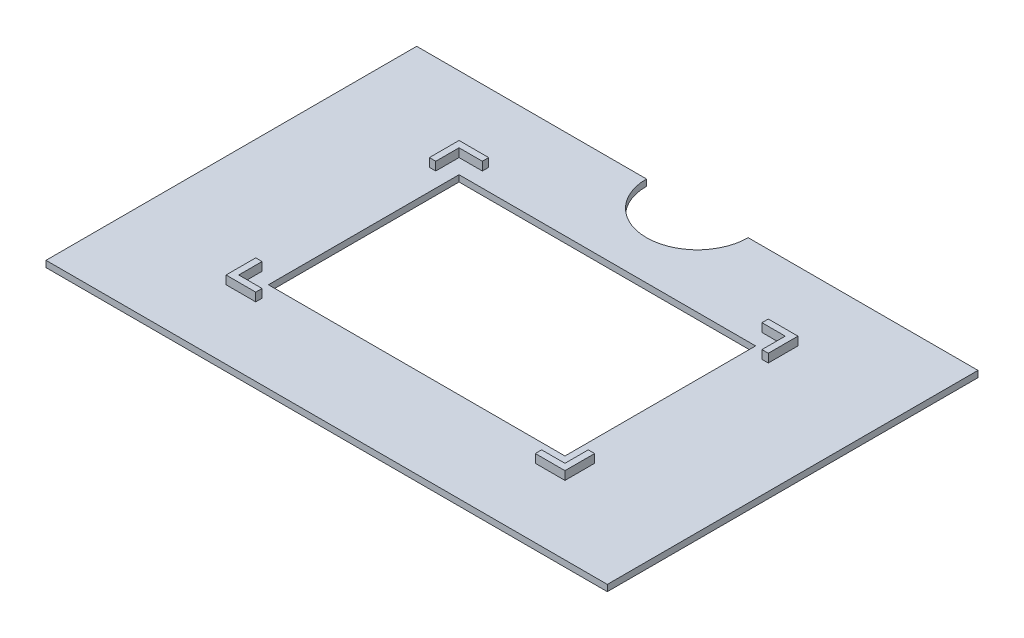
ISO-10303-21;
HEADER;
FILE_DESCRIPTION(('STEP AP214'),'2;1');
FILE_NAME('part.step','',(''),(''),'','','');
FILE_SCHEMA(('AUTOMOTIVE_DESIGN { 1 0 10303 214 1 1 1 1 }'));
ENDSEC;
DATA;
#1=APPLICATION_CONTEXT('core data for automotive mechanical design processes');
#2=APPLICATION_PROTOCOL_DEFINITION('international standard','automotive_design',2000,#1);
#3=PRODUCT_CONTEXT('',#1,'mechanical');
#4=PRODUCT('Part','Part','',(#3));
#5=PRODUCT_RELATED_PRODUCT_CATEGORY('part','',(#4));
#6=PRODUCT_DEFINITION_FORMATION('','',#4);
#7=PRODUCT_DEFINITION_CONTEXT('part definition',#1,'design');
#8=PRODUCT_DEFINITION('design','',#6,#7);
#9=PRODUCT_DEFINITION_SHAPE('','',#8);
#10=(LENGTH_UNIT() NAMED_UNIT(*) SI_UNIT(.MILLI.,.METRE.));
#11=(NAMED_UNIT(*) PLANE_ANGLE_UNIT() SI_UNIT($,.RADIAN.));
#12=(NAMED_UNIT(*) SI_UNIT($,.STERADIAN.) SOLID_ANGLE_UNIT());
#13=UNCERTAINTY_MEASURE_WITH_UNIT(LENGTH_MEASURE(1.E-05),#10,'distance_accuracy_value','');
#14=(GEOMETRIC_REPRESENTATION_CONTEXT(3) GLOBAL_UNCERTAINTY_ASSIGNED_CONTEXT((#13)) GLOBAL_UNIT_ASSIGNED_CONTEXT((#10,
#11,#12)) REPRESENTATION_CONTEXT('',''));
#15=CARTESIAN_POINT('',(0.,0.,0.));
#16=DIRECTION('',(0.,0.,1.));
#17=DIRECTION('',(1.,0.,0.));
#18=AXIS2_PLACEMENT_3D('',#15,#16,#17);
#19=CARTESIAN_POINT('',(66.25,1.5,-43.75));
#20=DIRECTION('',(0.,0.,1.));
#21=DIRECTION('',(1.,0.,0.));
#22=AXIS2_PLACEMENT_3D('',#19,#20,#21);
#23=PLANE('',#22);
#24=DIRECTION('',(-1.,0.,0.));
#25=VECTOR('',#24,1.);
#26=CARTESIAN_POINT('',(66.25,0.,-43.75));
#27=LINE('',#26,#25);
#28=CARTESIAN_POINT('',(66.25,0.,-43.75));
#29=VERTEX_POINT('',#28);
#30=CARTESIAN_POINT('',(12.,0.,-43.75));
#31=VERTEX_POINT('',#30);
#32=EDGE_CURVE('E266',#29,#31,#27,.T.);
#33=ORIENTED_EDGE('',*,*,#32,.T.);
#34=DIRECTION('',(0.,1.,0.));
#35=VECTOR('',#34,1.);
#36=CARTESIAN_POINT('',(12.,-26.8328157299975,-43.75));
#37=LINE('',#36,#35);
#38=CARTESIAN_POINT('',(12.,1.5,-43.75));
#39=VERTEX_POINT('',#38);
#40=EDGE_CURVE('E48',#31,#39,#37,.T.);
#41=ORIENTED_EDGE('',*,*,#40,.T.);
#42=DIRECTION('',(-1.,0.,0.));
#43=VECTOR('',#42,1.);
#44=CARTESIAN_POINT('',(66.25,1.5,-43.75));
#45=LINE('',#44,#43);
#46=CARTESIAN_POINT('',(66.25,1.5,-43.75));
#47=VERTEX_POINT('',#46);
#48=EDGE_CURVE('E264',#47,#39,#45,.T.);
#49=ORIENTED_EDGE('',*,*,#48,.F.);
#50=DIRECTION('',(0.,-1.,0.));
#51=VECTOR('',#50,1.);
#52=CARTESIAN_POINT('',(66.25,1.5,-43.75));
#53=LINE('',#52,#51);
#54=EDGE_CURVE('E277',#47,#29,#53,.T.);
#55=ORIENTED_EDGE('',*,*,#54,.T.);
#56=EDGE_LOOP('',(#33,#41,#49,#55));
#57=FACE_BOUND('',#56,.T.);
#58=ADVANCED_FACE('F33',(#57),#23,.F.);
#59=CARTESIAN_POINT('',(40.,3.5,27.5));
#60=DIRECTION('',(0.,0.,-1.));
#61=DIRECTION('',(-1.,0.,0.));
#62=AXIS2_PLACEMENT_3D('',#59,#60,#61);
#63=PLANE('',#62);
#64=DIRECTION('',(1.,0.,0.));
#65=VECTOR('',#64,1.);
#66=CARTESIAN_POINT('',(40.,1.5,27.5));
#67=LINE('',#66,#65);
#68=CARTESIAN_POINT('',(-40.,1.5,27.5));
#69=VERTEX_POINT('',#68);
#70=CARTESIAN_POINT('',(-33.,1.5,27.5));
#71=VERTEX_POINT('',#70);
#72=EDGE_CURVE('E475',#69,#71,#67,.T.);
#73=ORIENTED_EDGE('',*,*,#72,.T.);
#74=DIRECTION('',(0.,1.,0.));
#75=VECTOR('',#74,1.);
#76=CARTESIAN_POINT('',(-33.,-64.5170432539962,27.5));
#77=LINE('',#76,#75);
#78=CARTESIAN_POINT('',(-33.,3.5,27.5));
#79=VERTEX_POINT('',#78);
#80=EDGE_CURVE('E311',#71,#79,#77,.T.);
#81=ORIENTED_EDGE('',*,*,#80,.T.);
#82=DIRECTION('',(1.,0.,0.));
#83=VECTOR('',#82,1.);
#84=CARTESIAN_POINT('',(40.,3.5,27.5));
#85=LINE('',#84,#83);
#86=CARTESIAN_POINT('',(-40.,3.5,27.5));
#87=VERTEX_POINT('',#86);
#88=EDGE_CURVE('E459',#87,#79,#85,.T.);
#89=ORIENTED_EDGE('',*,*,#88,.F.);
#90=DIRECTION('',(0.,-1.,0.));
#91=VECTOR('',#90,1.);
#92=CARTESIAN_POINT('',(-40.,3.5,27.5));
#93=LINE('',#92,#91);
#94=EDGE_CURVE('E286',#87,#69,#93,.T.);
#95=ORIENTED_EDGE('',*,*,#94,.T.);
#96=EDGE_LOOP('',(#73,#81,#89,#95));
#97=FACE_BOUND('',#96,.T.);
#98=ADVANCED_FACE('F516',(#97),#63,.F.);
#99=CARTESIAN_POINT('',(0.,3.5,0.));
#100=DIRECTION('',(0.,1.,0.));
#101=DIRECTION('',(0.,0.,1.));
#102=AXIS2_PLACEMENT_3D('',#99,#100,#101);
#103=PLANE('',#102);
#104=DIRECTION('',(0.,0.,1.));
#105=VECTOR('',#104,1.);
#106=CARTESIAN_POINT('',(-33.,3.5,27.5));
#107=LINE('',#106,#105);
#108=CARTESIAN_POINT('',(-33.,3.5,26.));
#109=VERTEX_POINT('',#108);
#110=EDGE_CURVE('E306',#109,#79,#107,.T.);
#111=ORIENTED_EDGE('',*,*,#110,.F.);
#112=DIRECTION('',(1.,0.,0.));
#113=VECTOR('',#112,1.);
#114=CARTESIAN_POINT('',(38.5,3.5,26.));
#115=LINE('',#114,#113);
#116=CARTESIAN_POINT('',(-38.5,3.5,26.));
#117=VERTEX_POINT('',#116);
#118=EDGE_CURVE('E431',#117,#109,#115,.T.);
#119=ORIENTED_EDGE('',*,*,#118,.F.);
#120=DIRECTION('',(0.,0.,1.));
#121=VECTOR('',#120,1.);
#122=CARTESIAN_POINT('',(-38.5,3.5,26.));
#123=LINE('',#122,#121);
#124=CARTESIAN_POINT('',(-38.5,3.5,20.5));
#125=VERTEX_POINT('',#124);
#126=EDGE_CURVE('E409',#125,#117,#123,.T.);
#127=ORIENTED_EDGE('',*,*,#126,.F.);
#128=DIRECTION('',(1.,0.,0.));
#129=VECTOR('',#128,1.);
#130=CARTESIAN_POINT('',(-38.5,3.5,20.5));
#131=LINE('',#130,#129);
#132=CARTESIAN_POINT('',(-40.,3.5,20.5));
#133=VERTEX_POINT('',#132);
#134=EDGE_CURVE('E366',#133,#125,#131,.T.);
#135=ORIENTED_EDGE('',*,*,#134,.F.);
#136=DIRECTION('',(0.,0.,1.));
#137=VECTOR('',#136,1.);
#138=CARTESIAN_POINT('',(-40.,3.5,27.5));
#139=LINE('',#138,#137);
#140=EDGE_CURVE('E458',#133,#87,#139,.T.);
#141=ORIENTED_EDGE('',*,*,#140,.T.);
#142=ORIENTED_EDGE('',*,*,#88,.T.);
#143=EDGE_LOOP('',(#111,#119,#127,#135,#141,#142));
#144=FACE_BOUND('',#143,.T.);
#145=ADVANCED_FACE('F520',(#144),#103,.T.);
#146=CARTESIAN_POINT('',(38.5,1.5,26.));
#147=DIRECTION('',(0.,0.,1.));
#148=DIRECTION('',(1.,0.,0.));
#149=AXIS2_PLACEMENT_3D('',#146,#147,#148);
#150=PLANE('',#149);
#151=ORIENTED_EDGE('',*,*,#118,.T.);
#152=DIRECTION('',(0.,1.,0.));
#153=VECTOR('',#152,1.);
#154=CARTESIAN_POINT('',(-33.,-64.5170432539962,26.));
#155=LINE('',#154,#153);
#156=CARTESIAN_POINT('',(-33.,1.5,26.));
#157=VERTEX_POINT('',#156);
#158=EDGE_CURVE('E317',#157,#109,#155,.T.);
#159=ORIENTED_EDGE('',*,*,#158,.F.);
#160=DIRECTION('',(1.,0.,0.));
#161=VECTOR('',#160,1.);
#162=CARTESIAN_POINT('',(38.5,1.5,26.));
#163=LINE('',#162,#161);
#164=CARTESIAN_POINT('',(-38.5,1.5,26.));
#165=VERTEX_POINT('',#164);
#166=EDGE_CURVE('E415',#165,#157,#163,.T.);
#167=ORIENTED_EDGE('',*,*,#166,.F.);
#168=DIRECTION('',(0.,1.,0.));
#169=VECTOR('',#168,1.);
#170=CARTESIAN_POINT('',(-38.5,1.5,26.));
#171=LINE('',#170,#169);
#172=EDGE_CURVE('E426',#165,#117,#171,.T.);
#173=ORIENTED_EDGE('',*,*,#172,.T.);
#174=EDGE_LOOP('',(#151,#159,#167,#173));
#175=FACE_BOUND('',#174,.T.);
#176=ADVANCED_FACE('F527',(#175),#150,.F.);
#177=DIRECTION('',(0.,0.,1.));
#178=VECTOR('',#177,1.);
#179=CARTESIAN_POINT('',(-33.,3.5,-27.5));
#180=LINE('',#179,#178);
#181=CARTESIAN_POINT('',(-33.,3.5,-27.5));
#182=VERTEX_POINT('',#181);
#183=CARTESIAN_POINT('',(-33.,3.5,-26.));
#184=VERTEX_POINT('',#183);
#185=EDGE_CURVE('E324',#182,#184,#180,.T.);
#186=ORIENTED_EDGE('',*,*,#185,.F.);
#187=DIRECTION('',(-1.,0.,0.));
#188=VECTOR('',#187,1.);
#189=CARTESIAN_POINT('',(40.,3.5,-27.5));
#190=LINE('',#189,#188);
#191=CARTESIAN_POINT('',(-40.,3.5,-27.5));
#192=VERTEX_POINT('',#191);
#193=EDGE_CURVE('E466',#182,#192,#190,.T.);
#194=ORIENTED_EDGE('',*,*,#193,.T.);
#195=CARTESIAN_POINT('',(-40.,3.5,-20.5));
#196=VERTEX_POINT('',#195);
#197=EDGE_CURVE('E454',#192,#196,#139,.T.);
#198=ORIENTED_EDGE('',*,*,#197,.T.);
#199=DIRECTION('',(-1.,0.,0.));
#200=VECTOR('',#199,1.);
#201=CARTESIAN_POINT('',(-38.5,3.5,-20.5));
#202=LINE('',#201,#200);
#203=CARTESIAN_POINT('',(-38.5,3.5,-20.5));
#204=VERTEX_POINT('',#203);
#205=EDGE_CURVE('E360',#204,#196,#202,.T.);
#206=ORIENTED_EDGE('',*,*,#205,.F.);
#207=CARTESIAN_POINT('',(-38.5,3.5,-26.));
#208=VERTEX_POINT('',#207);
#209=EDGE_CURVE('E427',#208,#204,#123,.T.);
#210=ORIENTED_EDGE('',*,*,#209,.F.);
#211=DIRECTION('',(-1.,0.,0.));
#212=VECTOR('',#211,1.);
#213=CARTESIAN_POINT('',(38.5,3.5,-26.));
#214=LINE('',#213,#212);
#215=EDGE_CURVE('E438',#184,#208,#214,.T.);
#216=ORIENTED_EDGE('',*,*,#215,.F.);
#217=EDGE_LOOP('',(#186,#194,#198,#206,#210,#216));
#218=FACE_BOUND('',#217,.T.);
#219=ADVANCED_FACE('F530',(#218),#103,.T.);
#220=CARTESIAN_POINT('',(40.,3.5,-27.5));
#221=DIRECTION('',(0.,0.,1.));
#222=DIRECTION('',(1.,0.,0.));
#223=AXIS2_PLACEMENT_3D('',#220,#221,#222);
#224=PLANE('',#223);
#225=ORIENTED_EDGE('',*,*,#193,.F.);
#226=DIRECTION('',(0.,1.,0.));
#227=VECTOR('',#226,1.);
#228=CARTESIAN_POINT('',(-33.,-64.5170432539962,-27.5));
#229=LINE('',#228,#227);
#230=CARTESIAN_POINT('',(-33.,1.5,-27.5));
#231=VERTEX_POINT('',#230);
#232=EDGE_CURVE('E328',#231,#182,#229,.T.);
#233=ORIENTED_EDGE('',*,*,#232,.F.);
#234=DIRECTION('',(-1.,0.,0.));
#235=VECTOR('',#234,1.);
#236=CARTESIAN_POINT('',(40.,1.5,-27.5));
#237=LINE('',#236,#235);
#238=CARTESIAN_POINT('',(-40.,1.5,-27.5));
#239=VERTEX_POINT('',#238);
#240=EDGE_CURVE('E482',#231,#239,#237,.T.);
#241=ORIENTED_EDGE('',*,*,#240,.T.);
#242=DIRECTION('',(0.,-1.,0.));
#243=VECTOR('',#242,1.);
#244=CARTESIAN_POINT('',(-40.,3.5,-27.5));
#245=LINE('',#244,#243);
#246=EDGE_CURVE('E470',#192,#239,#245,.T.);
#247=ORIENTED_EDGE('',*,*,#246,.F.);
#248=EDGE_LOOP('',(#225,#233,#241,#247));
#249=FACE_BOUND('',#248,.T.);
#250=ADVANCED_FACE('F627',(#249),#224,.F.);
#251=CARTESIAN_POINT('',(38.5,1.5,-26.));
#252=DIRECTION('',(0.,0.,-1.));
#253=DIRECTION('',(-1.,0.,0.));
#254=AXIS2_PLACEMENT_3D('',#251,#252,#253);
#255=PLANE('',#254);
#256=DIRECTION('',(-1.,0.,0.));
#257=VECTOR('',#256,1.);
#258=CARTESIAN_POINT('',(38.5,1.5,-26.));
#259=LINE('',#258,#257);
#260=CARTESIAN_POINT('',(-33.,1.5,-26.));
#261=VERTEX_POINT('',#260);
#262=CARTESIAN_POINT('',(-38.5,1.5,-26.));
#263=VERTEX_POINT('',#262);
#264=EDGE_CURVE('E422',#261,#263,#259,.T.);
#265=ORIENTED_EDGE('',*,*,#264,.F.);
#266=DIRECTION('',(0.,1.,0.));
#267=VECTOR('',#266,1.);
#268=CARTESIAN_POINT('',(-33.,-64.5170432539962,-26.));
#269=LINE('',#268,#267);
#270=EDGE_CURVE('E334',#261,#184,#269,.T.);
#271=ORIENTED_EDGE('',*,*,#270,.T.);
#272=ORIENTED_EDGE('',*,*,#215,.T.);
#273=DIRECTION('',(0.,1.,0.));
#274=VECTOR('',#273,1.);
#275=CARTESIAN_POINT('',(-38.5,1.5,-26.));
#276=LINE('',#275,#274);
#277=EDGE_CURVE('E442',#263,#208,#276,.T.);
#278=ORIENTED_EDGE('',*,*,#277,.F.);
#279=EDGE_LOOP('',(#265,#271,#272,#278));
#280=FACE_BOUND('',#279,.T.);
#281=ADVANCED_FACE('F613',(#280),#255,.F.);
#282=CARTESIAN_POINT('',(40.,3.5,27.5));
#283=DIRECTION('',(-1.,0.,0.));
#284=DIRECTION('',(0.,0.,1.));
#285=AXIS2_PLACEMENT_3D('',#282,#283,#284);
#286=PLANE('',#285);
#287=DIRECTION('',(0.,0.,-1.));
#288=VECTOR('',#287,1.);
#289=CARTESIAN_POINT('',(40.,3.5,27.5));
#290=LINE('',#289,#288);
#291=CARTESIAN_POINT('',(40.,3.5,-20.5));
#292=VERTEX_POINT('',#291);
#293=CARTESIAN_POINT('',(40.,3.5,-27.5));
#294=VERTEX_POINT('',#293);
#295=EDGE_CURVE('E462',#292,#294,#290,.T.);
#296=ORIENTED_EDGE('',*,*,#295,.F.);
#297=DIRECTION('',(0.,1.,0.));
#298=VECTOR('',#297,1.);
#299=CARTESIAN_POINT('',(40.,-64.5170432539962,-20.5));
#300=LINE('',#299,#298);
#301=CARTESIAN_POINT('',(40.,1.5,-20.5));
#302=VERTEX_POINT('',#301);
#303=EDGE_CURVE('E353',#302,#292,#300,.T.);
#304=ORIENTED_EDGE('',*,*,#303,.F.);
#305=DIRECTION('',(0.,0.,-1.));
#306=VECTOR('',#305,1.);
#307=CARTESIAN_POINT('',(40.,1.5,27.5));
#308=LINE('',#307,#306);
#309=CARTESIAN_POINT('',(40.,1.5,-27.5));
#310=VERTEX_POINT('',#309);
#311=EDGE_CURVE('E478',#302,#310,#308,.T.);
#312=ORIENTED_EDGE('',*,*,#311,.T.);
#313=DIRECTION('',(0.,-1.,0.));
#314=VECTOR('',#313,1.);
#315=CARTESIAN_POINT('',(40.,3.5,-27.5));
#316=LINE('',#315,#314);
#317=EDGE_CURVE('E488',#294,#310,#316,.T.);
#318=ORIENTED_EDGE('',*,*,#317,.F.);
#319=EDGE_LOOP('',(#296,#304,#312,#318));
#320=FACE_BOUND('',#319,.T.);
#321=ADVANCED_FACE('F543',(#320),#286,.F.);
#322=DIRECTION('',(0.,0.,-1.));
#323=VECTOR('',#322,1.);
#324=CARTESIAN_POINT('',(33.,3.5,-27.5));
#325=LINE('',#324,#323);
#326=CARTESIAN_POINT('',(33.,3.5,-26.));
#327=VERTEX_POINT('',#326);
#328=CARTESIAN_POINT('',(33.,3.5,-27.5));
#329=VERTEX_POINT('',#328);
#330=EDGE_CURVE('E332',#327,#329,#325,.T.);
#331=ORIENTED_EDGE('',*,*,#330,.F.);
#332=CARTESIAN_POINT('',(38.5,3.5,-26.));
#333=VERTEX_POINT('',#332);
#334=EDGE_CURVE('E439',#333,#327,#214,.T.);
#335=ORIENTED_EDGE('',*,*,#334,.F.);
#336=DIRECTION('',(0.,0.,-1.));
#337=VECTOR('',#336,1.);
#338=CARTESIAN_POINT('',(38.5,3.5,26.));
#339=LINE('',#338,#337);
#340=CARTESIAN_POINT('',(38.5,3.5,-20.5));
#341=VERTEX_POINT('',#340);
#342=EDGE_CURVE('E434',#341,#333,#339,.T.);
#343=ORIENTED_EDGE('',*,*,#342,.F.);
#344=DIRECTION('',(-1.,0.,0.));
#345=VECTOR('',#344,1.);
#346=CARTESIAN_POINT('',(38.5,3.5,-20.5));
#347=LINE('',#346,#345);
#348=EDGE_CURVE('E348',#292,#341,#347,.T.);
#349=ORIENTED_EDGE('',*,*,#348,.F.);
#350=ORIENTED_EDGE('',*,*,#295,.T.);
#351=EDGE_CURVE('E467',#294,#329,#190,.T.);
#352=ORIENTED_EDGE('',*,*,#351,.T.);
#353=EDGE_LOOP('',(#331,#335,#343,#349,#350,#352));
#354=FACE_BOUND('',#353,.T.);
#355=ADVANCED_FACE('F624',(#354),#103,.T.);
#356=CARTESIAN_POINT('',(38.5,1.5,26.));
#357=DIRECTION('',(1.,0.,0.));
#358=DIRECTION('',(0.,0.,-1.));
#359=AXIS2_PLACEMENT_3D('',#356,#357,#358);
#360=PLANE('',#359);
#361=DIRECTION('',(0.,0.,-1.));
#362=VECTOR('',#361,1.);
#363=CARTESIAN_POINT('',(38.5,1.5,26.));
#364=LINE('',#363,#362);
#365=CARTESIAN_POINT('',(38.5,1.5,-20.5));
#366=VERTEX_POINT('',#365);
#367=CARTESIAN_POINT('',(38.5,1.5,-26.));
#368=VERTEX_POINT('',#367);
#369=EDGE_CURVE('E418',#366,#368,#364,.T.);
#370=ORIENTED_EDGE('',*,*,#369,.F.);
#371=DIRECTION('',(0.,1.,0.));
#372=VECTOR('',#371,1.);
#373=CARTESIAN_POINT('',(38.5,-64.5170432539962,-20.5));
#374=LINE('',#373,#372);
#375=EDGE_CURVE('E346',#366,#341,#374,.T.);
#376=ORIENTED_EDGE('',*,*,#375,.T.);
#377=ORIENTED_EDGE('',*,*,#342,.T.);
#378=DIRECTION('',(0.,1.,0.));
#379=VECTOR('',#378,1.);
#380=CARTESIAN_POINT('',(38.5,1.5,-26.));
#381=LINE('',#380,#379);
#382=EDGE_CURVE('E446',#368,#333,#381,.T.);
#383=ORIENTED_EDGE('',*,*,#382,.F.);
#384=EDGE_LOOP('',(#370,#376,#377,#383));
#385=FACE_BOUND('',#384,.T.);
#386=ADVANCED_FACE('F616',(#385),#360,.F.);
#387=CARTESIAN_POINT('',(-40.,3.5,27.5));
#388=DIRECTION('',(1.,0.,0.));
#389=DIRECTION('',(0.,0.,-1.));
#390=AXIS2_PLACEMENT_3D('',#387,#388,#389);
#391=PLANE('',#390);
#392=ORIENTED_EDGE('',*,*,#140,.F.);
#393=DIRECTION('',(0.,1.,0.));
#394=VECTOR('',#393,1.);
#395=CARTESIAN_POINT('',(-40.,-64.5170432539962,20.5));
#396=LINE('',#395,#394);
#397=CARTESIAN_POINT('',(-40.,1.5,20.5));
#398=VERTEX_POINT('',#397);
#399=EDGE_CURVE('E371',#398,#133,#396,.T.);
#400=ORIENTED_EDGE('',*,*,#399,.F.);
#401=DIRECTION('',(0.,0.,1.));
#402=VECTOR('',#401,1.);
#403=CARTESIAN_POINT('',(-40.,1.5,27.5));
#404=LINE('',#403,#402);
#405=EDGE_CURVE('E445',#398,#69,#404,.T.);
#406=ORIENTED_EDGE('',*,*,#405,.T.);
#407=ORIENTED_EDGE('',*,*,#94,.F.);
#408=EDGE_LOOP('',(#392,#400,#406,#407));
#409=FACE_BOUND('',#408,.T.);
#410=ADVANCED_FACE('F545',(#409),#391,.F.);
#411=CARTESIAN_POINT('',(-38.5,1.5,26.));
#412=DIRECTION('',(-1.,0.,0.));
#413=DIRECTION('',(0.,0.,1.));
#414=AXIS2_PLACEMENT_3D('',#411,#412,#413);
#415=PLANE('',#414);
#416=DIRECTION('',(0.,0.,1.));
#417=VECTOR('',#416,1.);
#418=CARTESIAN_POINT('',(-38.5,1.5,26.));
#419=LINE('',#418,#417);
#420=CARTESIAN_POINT('',(-38.5,1.5,20.5));
#421=VERTEX_POINT('',#420);
#422=EDGE_CURVE('E414',#421,#165,#419,.T.);
#423=ORIENTED_EDGE('',*,*,#422,.F.);
#424=DIRECTION('',(0.,1.,0.));
#425=VECTOR('',#424,1.);
#426=CARTESIAN_POINT('',(-38.5,-64.5170432539962,20.5));
#427=LINE('',#426,#425);
#428=EDGE_CURVE('E364',#421,#125,#427,.T.);
#429=ORIENTED_EDGE('',*,*,#428,.T.);
#430=ORIENTED_EDGE('',*,*,#126,.T.);
#431=ORIENTED_EDGE('',*,*,#172,.F.);
#432=EDGE_LOOP('',(#423,#429,#430,#431));
#433=FACE_BOUND('',#432,.T.);
#434=ADVANCED_FACE('F621',(#433),#415,.F.);
#435=CARTESIAN_POINT('',(0.,1.5,0.));
#436=DIRECTION('',(0.,1.,0.));
#437=DIRECTION('',(0.,0.,1.));
#438=AXIS2_PLACEMENT_3D('',#435,#436,#437);
#439=PLANE('',#438);
#440=CARTESIAN_POINT('',(0.,1.5,-43.75));
#441=DIRECTION('',(0.,1.,0.));
#442=DIRECTION('',(0.,0.,1.));
#443=AXIS2_PLACEMENT_3D('',#440,#441,#442);
#444=CIRCLE('',#443,12.);
#445=CARTESIAN_POINT('',(-12.,1.5,-43.75));
#446=VERTEX_POINT('',#445);
#447=EDGE_CURVE('E252',#446,#39,#444,.T.);
#448=ORIENTED_EDGE('',*,*,#447,.F.);
#449=CARTESIAN_POINT('',(-66.25,1.5,-43.75));
#450=VERTEX_POINT('',#449);
#451=EDGE_CURVE('E274',#446,#450,#45,.T.);
#452=ORIENTED_EDGE('',*,*,#451,.T.);
#453=DIRECTION('',(0.,0.,1.));
#454=VECTOR('',#453,1.);
#455=CARTESIAN_POINT('',(-66.25,1.5,43.75));
#456=LINE('',#455,#454);
#457=CARTESIAN_POINT('',(-66.25,1.5,43.75));
#458=VERTEX_POINT('',#457);
#459=EDGE_CURVE('E291',#450,#458,#456,.T.);
#460=ORIENTED_EDGE('',*,*,#459,.T.);
#461=DIRECTION('',(1.,0.,0.));
#462=VECTOR('',#461,1.);
#463=CARTESIAN_POINT('',(66.25,1.5,43.75));
#464=LINE('',#463,#462);
#465=CARTESIAN_POINT('',(66.25,1.5,43.75));
#466=VERTEX_POINT('',#465);
#467=EDGE_CURVE('E497',#458,#466,#464,.T.);
#468=ORIENTED_EDGE('',*,*,#467,.T.);
#469=DIRECTION('',(0.,0.,-1.));
#470=VECTOR('',#469,1.);
#471=CARTESIAN_POINT('',(66.25,1.5,43.75));
#472=LINE('',#471,#470);
#473=EDGE_CURVE('E271',#466,#47,#472,.T.);
#474=ORIENTED_EDGE('',*,*,#473,.T.);
#475=ORIENTED_EDGE('',*,*,#48,.T.);
#476=EDGE_LOOP('',(#448,#452,#460,#468,#474,#475));
#477=FACE_BOUND('',#476,.T.);
#478=DIRECTION('',(0.,0.,-1.));
#479=VECTOR('',#478,1.);
#480=CARTESIAN_POINT('',(-33.,1.5,27.5));
#481=LINE('',#480,#479);
#482=EDGE_CURVE('E310',#71,#157,#481,.T.);
#483=ORIENTED_EDGE('',*,*,#482,.F.);
#484=ORIENTED_EDGE('',*,*,#72,.F.);
#485=ORIENTED_EDGE('',*,*,#405,.F.);
#486=DIRECTION('',(-1.,0.,0.));
#487=VECTOR('',#486,1.);
#488=CARTESIAN_POINT('',(-38.5,1.5,20.5));
#489=LINE('',#488,#487);
#490=EDGE_CURVE('E361',#421,#398,#489,.T.);
#491=ORIENTED_EDGE('',*,*,#490,.F.);
#492=ORIENTED_EDGE('',*,*,#422,.T.);
#493=ORIENTED_EDGE('',*,*,#166,.T.);
#494=EDGE_LOOP('',(#483,#484,#485,#491,#492,#493));
#495=FACE_BOUND('',#494,.T.);
#496=DIRECTION('',(0.,0.,1.));
#497=VECTOR('',#496,1.);
#498=CARTESIAN_POINT('',(33.,1.5,-27.5));
#499=LINE('',#498,#497);
#500=CARTESIAN_POINT('',(33.,1.5,-27.5));
#501=VERTEX_POINT('',#500);
#502=CARTESIAN_POINT('',(33.,1.5,-26.));
#503=VERTEX_POINT('',#502);
#504=EDGE_CURVE('E325',#501,#503,#499,.T.);
#505=ORIENTED_EDGE('',*,*,#504,.F.);
#506=EDGE_CURVE('E483',#310,#501,#237,.T.);
#507=ORIENTED_EDGE('',*,*,#506,.F.);
#508=ORIENTED_EDGE('',*,*,#311,.F.);
#509=DIRECTION('',(1.,0.,0.));
#510=VECTOR('',#509,1.);
#511=CARTESIAN_POINT('',(38.5,1.5,-20.5));
#512=LINE('',#511,#510);
#513=EDGE_CURVE('E343',#366,#302,#512,.T.);
#514=ORIENTED_EDGE('',*,*,#513,.F.);
#515=ORIENTED_EDGE('',*,*,#369,.T.);
#516=EDGE_CURVE('E423',#368,#503,#259,.T.);
#517=ORIENTED_EDGE('',*,*,#516,.T.);
#518=EDGE_LOOP('',(#505,#507,#508,#514,#515,#517));
#519=FACE_BOUND('',#518,.T.);
#520=DIRECTION('',(-1.,0.,0.));
#521=VECTOR('',#520,1.);
#522=CARTESIAN_POINT('',(38.5,1.5,20.5));
#523=LINE('',#522,#521);
#524=CARTESIAN_POINT('',(40.,1.5,20.5));
#525=VERTEX_POINT('',#524);
#526=CARTESIAN_POINT('',(38.5,1.5,20.5));
#527=VERTEX_POINT('',#526);
#528=EDGE_CURVE('E345',#525,#527,#523,.T.);
#529=ORIENTED_EDGE('',*,*,#528,.F.);
#530=CARTESIAN_POINT('',(40.,1.5,27.5));
#531=VERTEX_POINT('',#530);
#532=EDGE_CURVE('E479',#531,#525,#308,.T.);
#533=ORIENTED_EDGE('',*,*,#532,.F.);
#534=CARTESIAN_POINT('',(33.,1.5,27.5));
#535=VERTEX_POINT('',#534);
#536=EDGE_CURVE('E474',#535,#531,#67,.T.);
#537=ORIENTED_EDGE('',*,*,#536,.F.);
#538=DIRECTION('',(0.,0.,1.));
#539=VECTOR('',#538,1.);
#540=CARTESIAN_POINT('',(33.,1.5,27.5));
#541=LINE('',#540,#539);
#542=CARTESIAN_POINT('',(33.,1.5,26.));
#543=VERTEX_POINT('',#542);
#544=EDGE_CURVE('E56',#543,#535,#541,.T.);
#545=ORIENTED_EDGE('',*,*,#544,.F.);
#546=CARTESIAN_POINT('',(38.5,1.5,26.));
#547=VERTEX_POINT('',#546);
#548=EDGE_CURVE('E413',#543,#547,#163,.T.);
#549=ORIENTED_EDGE('',*,*,#548,.T.);
#550=EDGE_CURVE('E419',#547,#527,#364,.T.);
#551=ORIENTED_EDGE('',*,*,#550,.T.);
#552=EDGE_LOOP('',(#529,#533,#537,#545,#549,#551));
#553=FACE_BOUND('',#552,.T.);
#554=ORIENTED_EDGE('',*,*,#240,.F.);
#555=DIRECTION('',(0.,0.,-1.));
#556=VECTOR('',#555,1.);
#557=CARTESIAN_POINT('',(-33.,1.5,-27.5));
#558=LINE('',#557,#556);
#559=EDGE_CURVE('E327',#261,#231,#558,.T.);
#560=ORIENTED_EDGE('',*,*,#559,.F.);
#561=ORIENTED_EDGE('',*,*,#264,.T.);
#562=CARTESIAN_POINT('',(-38.5,1.5,-20.5));
#563=VERTEX_POINT('',#562);
#564=EDGE_CURVE('E410',#263,#563,#419,.T.);
#565=ORIENTED_EDGE('',*,*,#564,.T.);
#566=DIRECTION('',(1.,0.,0.));
#567=VECTOR('',#566,1.);
#568=CARTESIAN_POINT('',(-38.5,1.5,-20.5));
#569=LINE('',#568,#567);
#570=CARTESIAN_POINT('',(-40.,1.5,-20.5));
#571=VERTEX_POINT('',#570);
#572=EDGE_CURVE('E363',#571,#563,#569,.T.);
#573=ORIENTED_EDGE('',*,*,#572,.F.);
#574=EDGE_CURVE('E471',#239,#571,#404,.T.);
#575=ORIENTED_EDGE('',*,*,#574,.F.);
#576=EDGE_LOOP('',(#554,#560,#561,#565,#573,#575));
#577=FACE_BOUND('',#576,.T.);
#578=DIRECTION('',(0.,0.,-1.));
#579=VECTOR('',#578,1.);
#580=CARTESIAN_POINT('',(35.,1.5,-22.5));
#581=LINE('',#580,#579);
#582=CARTESIAN_POINT('',(35.,1.5,22.5));
#583=VERTEX_POINT('',#582);
#584=CARTESIAN_POINT('',(35.,1.5,-22.5));
#585=VERTEX_POINT('',#584);
#586=EDGE_CURVE('E386',#583,#585,#581,.T.);
#587=ORIENTED_EDGE('',*,*,#586,.F.);
#588=DIRECTION('',(1.,0.,0.));
#589=VECTOR('',#588,1.);
#590=CARTESIAN_POINT('',(-35.,1.5,22.5));
#591=LINE('',#590,#589);
#592=CARTESIAN_POINT('',(-35.,1.5,22.5));
#593=VERTEX_POINT('',#592);
#594=EDGE_CURVE('E394',#593,#583,#591,.T.);
#595=ORIENTED_EDGE('',*,*,#594,.F.);
#596=DIRECTION('',(0.,0.,1.));
#597=VECTOR('',#596,1.);
#598=CARTESIAN_POINT('',(-35.,1.5,-22.5));
#599=LINE('',#598,#597);
#600=CARTESIAN_POINT('',(-35.,1.5,-22.5));
#601=VERTEX_POINT('',#600);
#602=EDGE_CURVE('E391',#601,#593,#599,.T.);
#603=ORIENTED_EDGE('',*,*,#602,.F.);
#604=DIRECTION('',(-1.,0.,0.));
#605=VECTOR('',#604,1.);
#606=CARTESIAN_POINT('',(-35.,1.5,-22.5));
#607=LINE('',#606,#605);
#608=EDGE_CURVE('E388',#585,#601,#607,.T.);
#609=ORIENTED_EDGE('',*,*,#608,.F.);
#610=EDGE_LOOP('',(#587,#595,#603,#609));
#611=FACE_BOUND('',#610,.T.);
#612=ADVANCED_FACE('F268',(#477,#495,#519,#553,#577,#611),#439,.T.);
#613=CARTESIAN_POINT('',(-66.25,1.5,43.75));
#614=DIRECTION('',(1.,0.,0.));
#615=DIRECTION('',(0.,0.,-1.));
#616=AXIS2_PLACEMENT_3D('',#613,#614,#615);
#617=PLANE('',#616);
#618=DIRECTION('',(0.,0.,1.));
#619=VECTOR('',#618,1.);
#620=CARTESIAN_POINT('',(-66.25,0.,43.75));
#621=LINE('',#620,#619);
#622=CARTESIAN_POINT('',(-66.25,0.,-43.75));
#623=VERTEX_POINT('',#622);
#624=CARTESIAN_POINT('',(-66.25,0.,43.75));
#625=VERTEX_POINT('',#624);
#626=EDGE_CURVE('E282',#623,#625,#621,.T.);
#627=ORIENTED_EDGE('',*,*,#626,.T.);
#628=DIRECTION('',(0.,-1.,0.));
#629=VECTOR('',#628,1.);
#630=CARTESIAN_POINT('',(-66.25,1.5,43.75));
#631=LINE('',#630,#629);
#632=EDGE_CURVE('E11',#458,#625,#631,.T.);
#633=ORIENTED_EDGE('',*,*,#632,.F.);
#634=ORIENTED_EDGE('',*,*,#459,.F.);
#635=DIRECTION('',(0.,-1.,0.));
#636=VECTOR('',#635,1.);
#637=CARTESIAN_POINT('',(-66.25,1.5,-43.75));
#638=LINE('',#637,#636);
#639=EDGE_CURVE('E273',#450,#623,#638,.T.);
#640=ORIENTED_EDGE('',*,*,#639,.T.);
#641=EDGE_LOOP('',(#627,#633,#634,#640));
#642=FACE_BOUND('',#641,.T.);
#643=ADVANCED_FACE('F35',(#642),#617,.F.);
#644=CARTESIAN_POINT('',(66.25,1.5,43.75));
#645=DIRECTION('',(0.,0.,-1.));
#646=DIRECTION('',(-1.,0.,0.));
#647=AXIS2_PLACEMENT_3D('',#644,#645,#646);
#648=PLANE('',#647);
#649=DIRECTION('',(1.,0.,0.));
#650=VECTOR('',#649,1.);
#651=CARTESIAN_POINT('',(66.25,0.,43.75));
#652=LINE('',#651,#650);
#653=CARTESIAN_POINT('',(66.25,0.,43.75));
#654=VERTEX_POINT('',#653);
#655=EDGE_CURVE('E285',#625,#654,#652,.T.);
#656=ORIENTED_EDGE('',*,*,#655,.T.);
#657=DIRECTION('',(0.,-1.,0.));
#658=VECTOR('',#657,1.);
#659=CARTESIAN_POINT('',(66.25,1.5,43.75));
#660=LINE('',#659,#658);
#661=EDGE_CURVE('E41',#466,#654,#660,.T.);
#662=ORIENTED_EDGE('',*,*,#661,.F.);
#663=ORIENTED_EDGE('',*,*,#467,.F.);
#664=ORIENTED_EDGE('',*,*,#632,.T.);
#665=EDGE_LOOP('',(#656,#662,#663,#664));
#666=FACE_BOUND('',#665,.T.);
#667=ADVANCED_FACE('F500',(#666),#648,.F.);
#668=CARTESIAN_POINT('',(66.25,1.5,43.75));
#669=DIRECTION('',(-1.,0.,0.));
#670=DIRECTION('',(0.,0.,1.));
#671=AXIS2_PLACEMENT_3D('',#668,#669,#670);
#672=PLANE('',#671);
#673=DIRECTION('',(0.,0.,-1.));
#674=VECTOR('',#673,1.);
#675=CARTESIAN_POINT('',(66.25,0.,43.75));
#676=LINE('',#675,#674);
#677=EDGE_CURVE('E288',#654,#29,#676,.T.);
#678=ORIENTED_EDGE('',*,*,#677,.T.);
#679=ORIENTED_EDGE('',*,*,#54,.F.);
#680=ORIENTED_EDGE('',*,*,#473,.F.);
#681=ORIENTED_EDGE('',*,*,#661,.T.);
#682=EDGE_LOOP('',(#678,#679,#680,#681));
#683=FACE_BOUND('',#682,.T.);
#684=ADVANCED_FACE('F297',(#683),#672,.F.);
#685=ORIENTED_EDGE('',*,*,#451,.F.);
#686=DIRECTION('',(0.,1.,0.));
#687=VECTOR('',#686,1.);
#688=CARTESIAN_POINT('',(-12.,-26.8328157299975,-43.75));
#689=LINE('',#688,#687);
#690=CARTESIAN_POINT('',(-12.,0.,-43.75));
#691=VERTEX_POINT('',#690);
#692=EDGE_CURVE('E255',#691,#446,#689,.T.);
#693=ORIENTED_EDGE('',*,*,#692,.F.);
#694=EDGE_CURVE('E290',#691,#623,#27,.T.);
#695=ORIENTED_EDGE('',*,*,#694,.T.);
#696=ORIENTED_EDGE('',*,*,#639,.F.);
#697=EDGE_LOOP('',(#685,#693,#695,#696));
#698=FACE_BOUND('',#697,.T.);
#699=ADVANCED_FACE('F504',(#698),#23,.F.);
#700=CARTESIAN_POINT('',(0.,0.,0.));
#701=DIRECTION('',(0.,1.,0.));
#702=DIRECTION('',(0.,0.,1.));
#703=AXIS2_PLACEMENT_3D('',#700,#701,#702);
#704=PLANE('',#703);
#705=DIRECTION('',(-1.,0.,0.));
#706=VECTOR('',#705,1.);
#707=CARTESIAN_POINT('',(-35.,0.,22.5));
#708=LINE('',#707,#706);
#709=CARTESIAN_POINT('',(35.,0.,22.5));
#710=VERTEX_POINT('',#709);
#711=CARTESIAN_POINT('',(-35.,0.,22.5));
#712=VERTEX_POINT('',#711);
#713=EDGE_CURVE('E380',#710,#712,#708,.T.);
#714=ORIENTED_EDGE('',*,*,#713,.F.);
#715=DIRECTION('',(0.,0.,1.));
#716=VECTOR('',#715,1.);
#717=CARTESIAN_POINT('',(35.,0.,-22.5));
#718=LINE('',#717,#716);
#719=CARTESIAN_POINT('',(35.,0.,-22.5));
#720=VERTEX_POINT('',#719);
#721=EDGE_CURVE('E383',#720,#710,#718,.T.);
#722=ORIENTED_EDGE('',*,*,#721,.F.);
#723=DIRECTION('',(1.,0.,0.));
#724=VECTOR('',#723,1.);
#725=CARTESIAN_POINT('',(-35.,0.,-22.5));
#726=LINE('',#725,#724);
#727=CARTESIAN_POINT('',(-35.,0.,-22.5));
#728=VERTEX_POINT('',#727);
#729=EDGE_CURVE('E400',#728,#720,#726,.T.);
#730=ORIENTED_EDGE('',*,*,#729,.F.);
#731=DIRECTION('',(0.,0.,-1.));
#732=VECTOR('',#731,1.);
#733=CARTESIAN_POINT('',(-35.,0.,-22.5));
#734=LINE('',#733,#732);
#735=EDGE_CURVE('E378',#712,#728,#734,.T.);
#736=ORIENTED_EDGE('',*,*,#735,.F.);
#737=EDGE_LOOP('',(#714,#722,#730,#736));
#738=FACE_BOUND('',#737,.T.);
#739=ORIENTED_EDGE('',*,*,#694,.F.);
#740=CARTESIAN_POINT('',(0.,0.,-43.75));
#741=DIRECTION('',(0.,1.,0.));
#742=DIRECTION('',(0.,0.,1.));
#743=AXIS2_PLACEMENT_3D('',#740,#741,#742);
#744=CIRCLE('',#743,12.);
#745=EDGE_CURVE('E303',#31,#691,#744,.F.);
#746=ORIENTED_EDGE('',*,*,#745,.F.);
#747=ORIENTED_EDGE('',*,*,#32,.F.);
#748=ORIENTED_EDGE('',*,*,#677,.F.);
#749=ORIENTED_EDGE('',*,*,#655,.F.);
#750=ORIENTED_EDGE('',*,*,#626,.F.);
#751=EDGE_LOOP('',(#739,#746,#747,#748,#749,#750));
#752=FACE_BOUND('',#751,.T.);
#753=ADVANCED_FACE('F301',(#738,#752),#704,.F.);
#754=ORIENTED_EDGE('',*,*,#574,.T.);
#755=DIRECTION('',(0.,1.,0.));
#756=VECTOR('',#755,1.);
#757=CARTESIAN_POINT('',(-40.,-64.5170432539962,-20.5));
#758=LINE('',#757,#756);
#759=EDGE_CURVE('E373',#571,#196,#758,.T.);
#760=ORIENTED_EDGE('',*,*,#759,.T.);
#761=ORIENTED_EDGE('',*,*,#197,.F.);
#762=ORIENTED_EDGE('',*,*,#246,.T.);
#763=EDGE_LOOP('',(#754,#760,#761,#762));
#764=FACE_BOUND('',#763,.T.);
#765=ADVANCED_FACE('F511',(#764),#391,.F.);
#766=CARTESIAN_POINT('',(33.,3.5,27.5));
#767=VERTEX_POINT('',#766);
#768=CARTESIAN_POINT('',(40.,3.5,27.5));
#769=VERTEX_POINT('',#768);
#770=EDGE_CURVE('E457',#767,#769,#85,.T.);
#771=ORIENTED_EDGE('',*,*,#770,.F.);
#772=DIRECTION('',(0.,1.,0.));
#773=VECTOR('',#772,1.);
#774=CARTESIAN_POINT('',(33.,-64.5170432539962,27.5));
#775=LINE('',#774,#773);
#776=EDGE_CURVE('E314',#535,#767,#775,.T.);
#777=ORIENTED_EDGE('',*,*,#776,.F.);
#778=ORIENTED_EDGE('',*,*,#536,.T.);
#779=DIRECTION('',(0.,-1.,0.));
#780=VECTOR('',#779,1.);
#781=CARTESIAN_POINT('',(40.,3.5,27.5));
#782=LINE('',#781,#780);
#783=EDGE_CURVE('E491',#769,#531,#782,.T.);
#784=ORIENTED_EDGE('',*,*,#783,.F.);
#785=EDGE_LOOP('',(#771,#777,#778,#784));
#786=FACE_BOUND('',#785,.T.);
#787=ADVANCED_FACE('F523',(#786),#63,.F.);
#788=ORIENTED_EDGE('',*,*,#532,.T.);
#789=DIRECTION('',(0.,1.,0.));
#790=VECTOR('',#789,1.);
#791=CARTESIAN_POINT('',(40.,-64.5170432539962,20.5));
#792=LINE('',#791,#790);
#793=CARTESIAN_POINT('',(40.,3.5,20.5));
#794=VERTEX_POINT('',#793);
#795=EDGE_CURVE('E355',#525,#794,#792,.T.);
#796=ORIENTED_EDGE('',*,*,#795,.T.);
#797=EDGE_CURVE('E463',#769,#794,#290,.T.);
#798=ORIENTED_EDGE('',*,*,#797,.F.);
#799=ORIENTED_EDGE('',*,*,#783,.T.);
#800=EDGE_LOOP('',(#788,#796,#798,#799));
#801=FACE_BOUND('',#800,.T.);
#802=ADVANCED_FACE('F535',(#801),#286,.F.);
#803=ORIENTED_EDGE('',*,*,#506,.T.);
#804=DIRECTION('',(0.,1.,0.));
#805=VECTOR('',#804,1.);
#806=CARTESIAN_POINT('',(33.,-64.5170432539962,-27.5));
#807=LINE('',#806,#805);
#808=EDGE_CURVE('E336',#501,#329,#807,.T.);
#809=ORIENTED_EDGE('',*,*,#808,.T.);
#810=ORIENTED_EDGE('',*,*,#351,.F.);
#811=ORIENTED_EDGE('',*,*,#317,.T.);
#812=EDGE_LOOP('',(#803,#809,#810,#811));
#813=FACE_BOUND('',#812,.T.);
#814=ADVANCED_FACE('F541',(#813),#224,.F.);
#815=DIRECTION('',(0.,0.,-1.));
#816=VECTOR('',#815,1.);
#817=CARTESIAN_POINT('',(33.,3.5,27.5));
#818=LINE('',#817,#816);
#819=CARTESIAN_POINT('',(33.,3.5,26.));
#820=VERTEX_POINT('',#819);
#821=EDGE_CURVE('E304',#767,#820,#818,.T.);
#822=ORIENTED_EDGE('',*,*,#821,.F.);
#823=ORIENTED_EDGE('',*,*,#770,.T.);
#824=ORIENTED_EDGE('',*,*,#797,.T.);
#825=DIRECTION('',(1.,0.,0.));
#826=VECTOR('',#825,1.);
#827=CARTESIAN_POINT('',(38.5,3.5,20.5));
#828=LINE('',#827,#826);
#829=CARTESIAN_POINT('',(38.5,3.5,20.5));
#830=VERTEX_POINT('',#829);
#831=EDGE_CURVE('E330',#830,#794,#828,.T.);
#832=ORIENTED_EDGE('',*,*,#831,.F.);
#833=CARTESIAN_POINT('',(38.5,3.5,26.));
#834=VERTEX_POINT('',#833);
#835=EDGE_CURVE('E435',#834,#830,#339,.T.);
#836=ORIENTED_EDGE('',*,*,#835,.F.);
#837=EDGE_CURVE('E430',#820,#834,#115,.T.);
#838=ORIENTED_EDGE('',*,*,#837,.F.);
#839=EDGE_LOOP('',(#822,#823,#824,#832,#836,#838));
#840=FACE_BOUND('',#839,.T.);
#841=ADVANCED_FACE('F531',(#840),#103,.T.);
#842=ORIENTED_EDGE('',*,*,#209,.T.);
#843=DIRECTION('',(0.,1.,0.));
#844=VECTOR('',#843,1.);
#845=CARTESIAN_POINT('',(-38.5,-64.5170432539962,-20.5));
#846=LINE('',#845,#844);
#847=EDGE_CURVE('E368',#563,#204,#846,.T.);
#848=ORIENTED_EDGE('',*,*,#847,.F.);
#849=ORIENTED_EDGE('',*,*,#564,.F.);
#850=ORIENTED_EDGE('',*,*,#277,.T.);
#851=EDGE_LOOP('',(#842,#848,#849,#850));
#852=FACE_BOUND('',#851,.T.);
#853=ADVANCED_FACE('F611',(#852),#415,.F.);
#854=ORIENTED_EDGE('',*,*,#334,.T.);
#855=DIRECTION('',(0.,1.,0.));
#856=VECTOR('',#855,1.);
#857=CARTESIAN_POINT('',(33.,-64.5170432539962,-26.));
#858=LINE('',#857,#856);
#859=EDGE_CURVE('E339',#503,#327,#858,.T.);
#860=ORIENTED_EDGE('',*,*,#859,.F.);
#861=ORIENTED_EDGE('',*,*,#516,.F.);
#862=ORIENTED_EDGE('',*,*,#382,.T.);
#863=EDGE_LOOP('',(#854,#860,#861,#862));
#864=FACE_BOUND('',#863,.T.);
#865=ADVANCED_FACE('F608',(#864),#255,.F.);
#866=ORIENTED_EDGE('',*,*,#835,.T.);
#867=DIRECTION('',(0.,1.,0.));
#868=VECTOR('',#867,1.);
#869=CARTESIAN_POINT('',(38.5,-64.5170432539962,20.5));
#870=LINE('',#869,#868);
#871=EDGE_CURVE('E350',#527,#830,#870,.T.);
#872=ORIENTED_EDGE('',*,*,#871,.F.);
#873=ORIENTED_EDGE('',*,*,#550,.F.);
#874=DIRECTION('',(0.,1.,0.));
#875=VECTOR('',#874,1.);
#876=CARTESIAN_POINT('',(38.5,1.5,26.));
#877=LINE('',#876,#875);
#878=EDGE_CURVE('E449',#547,#834,#877,.T.);
#879=ORIENTED_EDGE('',*,*,#878,.T.);
#880=EDGE_LOOP('',(#866,#872,#873,#879));
#881=FACE_BOUND('',#880,.T.);
#882=ADVANCED_FACE('F567',(#881),#360,.F.);
#883=ORIENTED_EDGE('',*,*,#548,.F.);
#884=DIRECTION('',(0.,1.,0.));
#885=VECTOR('',#884,1.);
#886=CARTESIAN_POINT('',(33.,-64.5170432539962,26.));
#887=LINE('',#886,#885);
#888=EDGE_CURVE('E319',#543,#820,#887,.T.);
#889=ORIENTED_EDGE('',*,*,#888,.T.);
#890=ORIENTED_EDGE('',*,*,#837,.T.);
#891=ORIENTED_EDGE('',*,*,#878,.F.);
#892=EDGE_LOOP('',(#883,#889,#890,#891));
#893=FACE_BOUND('',#892,.T.);
#894=ADVANCED_FACE('F559',(#893),#150,.F.);
#895=CARTESIAN_POINT('',(35.,-0.000999999999999916,-22.5));
#896=DIRECTION('',(1.,0.,0.));
#897=DIRECTION('',(0.,0.,-1.));
#898=AXIS2_PLACEMENT_3D('',#895,#896,#897);
#899=PLANE('',#898);
#900=ORIENTED_EDGE('',*,*,#721,.T.);
#901=DIRECTION('',(0.,1.,0.));
#902=VECTOR('',#901,1.);
#903=CARTESIAN_POINT('',(35.,-0.000999999999999916,22.5));
#904=LINE('',#903,#902);
#905=EDGE_CURVE('E398',#710,#583,#904,.T.);
#906=ORIENTED_EDGE('',*,*,#905,.T.);
#907=ORIENTED_EDGE('',*,*,#586,.T.);
#908=DIRECTION('',(0.,1.,0.));
#909=VECTOR('',#908,1.);
#910=CARTESIAN_POINT('',(35.,-0.000999999999999916,-22.5));
#911=LINE('',#910,#909);
#912=EDGE_CURVE('E397',#720,#585,#911,.T.);
#913=ORIENTED_EDGE('',*,*,#912,.F.);
#914=EDGE_LOOP('',(#900,#906,#907,#913));
#915=FACE_BOUND('',#914,.T.);
#916=ADVANCED_FACE('F597',(#915),#899,.F.);
#917=CARTESIAN_POINT('',(-35.,-0.000999999999999916,22.5));
#918=DIRECTION('',(0.,0.,1.));
#919=DIRECTION('',(1.,0.,0.));
#920=AXIS2_PLACEMENT_3D('',#917,#918,#919);
#921=PLANE('',#920);
#922=ORIENTED_EDGE('',*,*,#713,.T.);
#923=DIRECTION('',(0.,1.,0.));
#924=VECTOR('',#923,1.);
#925=CARTESIAN_POINT('',(-35.,-0.000999999999999916,22.5));
#926=LINE('',#925,#924);
#927=EDGE_CURVE('E401',#712,#593,#926,.T.);
#928=ORIENTED_EDGE('',*,*,#927,.T.);
#929=ORIENTED_EDGE('',*,*,#594,.T.);
#930=ORIENTED_EDGE('',*,*,#905,.F.);
#931=EDGE_LOOP('',(#922,#928,#929,#930));
#932=FACE_BOUND('',#931,.T.);
#933=ADVANCED_FACE('F593',(#932),#921,.F.);
#934=CARTESIAN_POINT('',(-35.,-0.000999999999999916,-22.5));
#935=DIRECTION('',(-1.,0.,0.));
#936=DIRECTION('',(0.,0.,1.));
#937=AXIS2_PLACEMENT_3D('',#934,#935,#936);
#938=PLANE('',#937);
#939=ORIENTED_EDGE('',*,*,#735,.T.);
#940=DIRECTION('',(0.,1.,0.));
#941=VECTOR('',#940,1.);
#942=CARTESIAN_POINT('',(-35.,-0.000999999999999916,-22.5));
#943=LINE('',#942,#941);
#944=EDGE_CURVE('E403',#728,#601,#943,.T.);
#945=ORIENTED_EDGE('',*,*,#944,.T.);
#946=ORIENTED_EDGE('',*,*,#602,.T.);
#947=ORIENTED_EDGE('',*,*,#927,.F.);
#948=EDGE_LOOP('',(#939,#945,#946,#947));
#949=FACE_BOUND('',#948,.T.);
#950=ADVANCED_FACE('F596',(#949),#938,.F.);
#951=CARTESIAN_POINT('',(-35.,-0.000999999999999916,-22.5));
#952=DIRECTION('',(0.,0.,-1.));
#953=DIRECTION('',(-1.,0.,0.));
#954=AXIS2_PLACEMENT_3D('',#951,#952,#953);
#955=PLANE('',#954);
#956=ORIENTED_EDGE('',*,*,#729,.T.);
#957=ORIENTED_EDGE('',*,*,#912,.T.);
#958=ORIENTED_EDGE('',*,*,#608,.T.);
#959=ORIENTED_EDGE('',*,*,#944,.F.);
#960=EDGE_LOOP('',(#956,#957,#958,#959));
#961=FACE_BOUND('',#960,.T.);
#962=ADVANCED_FACE('F588',(#961),#955,.F.);
#963=CARTESIAN_POINT('',(-38.5,-64.5170432539962,20.5));
#964=DIRECTION('',(0.,0.,1.));
#965=DIRECTION('',(1.,0.,0.));
#966=AXIS2_PLACEMENT_3D('',#963,#964,#965);
#967=PLANE('',#966);
#968=ORIENTED_EDGE('',*,*,#490,.T.);
#969=ORIENTED_EDGE('',*,*,#399,.T.);
#970=ORIENTED_EDGE('',*,*,#134,.T.);
#971=ORIENTED_EDGE('',*,*,#428,.F.);
#972=EDGE_LOOP('',(#968,#969,#970,#971));
#973=FACE_BOUND('',#972,.T.);
#974=ADVANCED_FACE('F585',(#973),#967,.F.);
#975=CARTESIAN_POINT('',(-38.5,-64.5170432539962,-20.5));
#976=DIRECTION('',(0.,0.,-1.));
#977=DIRECTION('',(-1.,0.,0.));
#978=AXIS2_PLACEMENT_3D('',#975,#976,#977);
#979=PLANE('',#978);
#980=ORIENTED_EDGE('',*,*,#572,.T.);
#981=ORIENTED_EDGE('',*,*,#847,.T.);
#982=ORIENTED_EDGE('',*,*,#205,.T.);
#983=ORIENTED_EDGE('',*,*,#759,.F.);
#984=EDGE_LOOP('',(#980,#981,#982,#983));
#985=FACE_BOUND('',#984,.T.);
#986=ADVANCED_FACE('F581',(#985),#979,.F.);
#987=CARTESIAN_POINT('',(38.5,-64.5170432539962,-20.5));
#988=DIRECTION('',(0.,0.,-1.));
#989=DIRECTION('',(-1.,0.,0.));
#990=AXIS2_PLACEMENT_3D('',#987,#988,#989);
#991=PLANE('',#990);
#992=ORIENTED_EDGE('',*,*,#513,.T.);
#993=ORIENTED_EDGE('',*,*,#303,.T.);
#994=ORIENTED_EDGE('',*,*,#348,.T.);
#995=ORIENTED_EDGE('',*,*,#375,.F.);
#996=EDGE_LOOP('',(#992,#993,#994,#995));
#997=FACE_BOUND('',#996,.T.);
#998=ADVANCED_FACE('F572',(#997),#991,.F.);
#999=CARTESIAN_POINT('',(38.5,-64.5170432539962,20.5));
#1000=DIRECTION('',(0.,0.,1.));
#1001=DIRECTION('',(1.,0.,0.));
#1002=AXIS2_PLACEMENT_3D('',#999,#1000,#1001);
#1003=PLANE('',#1002);
#1004=ORIENTED_EDGE('',*,*,#528,.T.);
#1005=ORIENTED_EDGE('',*,*,#871,.T.);
#1006=ORIENTED_EDGE('',*,*,#831,.T.);
#1007=ORIENTED_EDGE('',*,*,#795,.F.);
#1008=EDGE_LOOP('',(#1004,#1005,#1006,#1007));
#1009=FACE_BOUND('',#1008,.T.);
#1010=ADVANCED_FACE('F569',(#1009),#1003,.F.);
#1011=CARTESIAN_POINT('',(-33.,-64.5170432539962,-27.5));
#1012=DIRECTION('',(-1.,0.,0.));
#1013=DIRECTION('',(0.,0.,1.));
#1014=AXIS2_PLACEMENT_3D('',#1011,#1012,#1013);
#1015=PLANE('',#1014);
#1016=ORIENTED_EDGE('',*,*,#559,.T.);
#1017=ORIENTED_EDGE('',*,*,#232,.T.);
#1018=ORIENTED_EDGE('',*,*,#185,.T.);
#1019=ORIENTED_EDGE('',*,*,#270,.F.);
#1020=EDGE_LOOP('',(#1016,#1017,#1018,#1019));
#1021=FACE_BOUND('',#1020,.T.);
#1022=ADVANCED_FACE('F571',(#1021),#1015,.F.);
#1023=CARTESIAN_POINT('',(33.,-64.5170432539962,-27.5));
#1024=DIRECTION('',(1.,0.,0.));
#1025=DIRECTION('',(0.,0.,-1.));
#1026=AXIS2_PLACEMENT_3D('',#1023,#1024,#1025);
#1027=PLANE('',#1026);
#1028=ORIENTED_EDGE('',*,*,#504,.T.);
#1029=ORIENTED_EDGE('',*,*,#859,.T.);
#1030=ORIENTED_EDGE('',*,*,#330,.T.);
#1031=ORIENTED_EDGE('',*,*,#808,.F.);
#1032=EDGE_LOOP('',(#1028,#1029,#1030,#1031));
#1033=FACE_BOUND('',#1032,.T.);
#1034=ADVANCED_FACE('F578',(#1033),#1027,.F.);
#1035=CARTESIAN_POINT('',(-33.,-64.5170432539962,27.5));
#1036=DIRECTION('',(-1.,0.,0.));
#1037=DIRECTION('',(0.,0.,1.));
#1038=AXIS2_PLACEMENT_3D('',#1035,#1036,#1037);
#1039=PLANE('',#1038);
#1040=ORIENTED_EDGE('',*,*,#482,.T.);
#1041=ORIENTED_EDGE('',*,*,#158,.T.);
#1042=ORIENTED_EDGE('',*,*,#110,.T.);
#1043=ORIENTED_EDGE('',*,*,#80,.F.);
#1044=EDGE_LOOP('',(#1040,#1041,#1042,#1043));
#1045=FACE_BOUND('',#1044,.T.);
#1046=ADVANCED_FACE('F691',(#1045),#1039,.F.);
#1047=CARTESIAN_POINT('',(33.,-64.5170432539962,27.5));
#1048=DIRECTION('',(1.,0.,0.));
#1049=DIRECTION('',(0.,0.,-1.));
#1050=AXIS2_PLACEMENT_3D('',#1047,#1048,#1049);
#1051=PLANE('',#1050);
#1052=ORIENTED_EDGE('',*,*,#544,.T.);
#1053=ORIENTED_EDGE('',*,*,#776,.T.);
#1054=ORIENTED_EDGE('',*,*,#821,.T.);
#1055=ORIENTED_EDGE('',*,*,#888,.F.);
#1056=EDGE_LOOP('',(#1052,#1053,#1054,#1055));
#1057=FACE_BOUND('',#1056,.T.);
#1058=ADVANCED_FACE('F556',(#1057),#1051,.F.);
#1059=CARTESIAN_POINT('',(0.,-26.8328157299975,-43.75));
#1060=DIRECTION('',(0.,1.,0.));
#1061=DIRECTION('',(0.,0.,1.));
#1062=AXIS2_PLACEMENT_3D('',#1059,#1060,#1061);
#1063=CYLINDRICAL_SURFACE('',#1062,12.);
#1064=ORIENTED_EDGE('',*,*,#745,.T.);
#1065=ORIENTED_EDGE('',*,*,#692,.T.);
#1066=ORIENTED_EDGE('',*,*,#447,.T.);
#1067=ORIENTED_EDGE('',*,*,#40,.F.);
#1068=EDGE_LOOP('',(#1064,#1065,#1066,#1067));
#1069=FACE_BOUND('',#1068,.T.);
#1070=ADVANCED_FACE('F253',(#1069),#1063,.F.);
#1071=CLOSED_SHELL('',(#58,#98,#145,#176,#219,#250,#281,#321,#355,#386,#410,#434,#612,#643,#667,
#684,#699,#753,#765,#787,#802,#814,#841,#853,#865,#882,#894,#916,#933,#950,#962,#974,#986,#998,
#1010,#1022,#1034,#1046,#1058,#1070));
#1072=MANIFOLD_SOLID_BREP('B2',#1071);
#1073=ADVANCED_BREP_SHAPE_REPRESENTATION('',(#18,#1072),#14);
#1074=SHAPE_DEFINITION_REPRESENTATION(#9,#1073);
ENDSEC;
END-ISO-10303-21;
